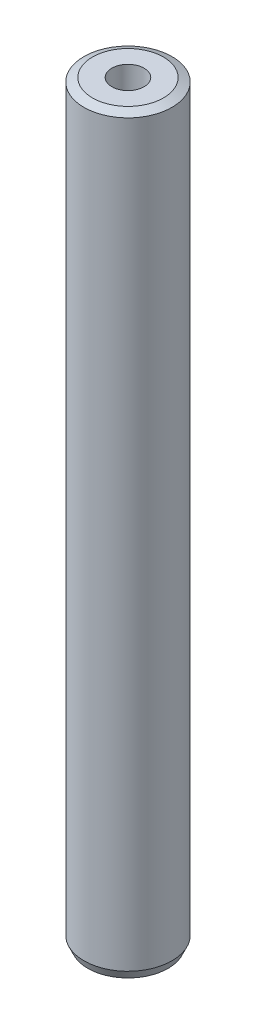
ISO-10303-21;
HEADER;
FILE_DESCRIPTION(('STEP AP214'),'2;1');
FILE_NAME('part.step','',(''),(''),'','','');
FILE_SCHEMA(('AUTOMOTIVE_DESIGN { 1 0 10303 214 1 1 1 1 }'));
ENDSEC;
DATA;
#1=APPLICATION_CONTEXT('core data for automotive mechanical design processes');
#2=APPLICATION_PROTOCOL_DEFINITION('international standard','automotive_design',2000,#1);
#3=PRODUCT_CONTEXT('',#1,'mechanical');
#4=PRODUCT('Part','Part','',(#3));
#5=PRODUCT_RELATED_PRODUCT_CATEGORY('part','',(#4));
#6=PRODUCT_DEFINITION_FORMATION('','',#4);
#7=PRODUCT_DEFINITION_CONTEXT('part definition',#1,'design');
#8=PRODUCT_DEFINITION('design','',#6,#7);
#9=PRODUCT_DEFINITION_SHAPE('','',#8);
#10=(LENGTH_UNIT() NAMED_UNIT(*) SI_UNIT(.MILLI.,.METRE.));
#11=(NAMED_UNIT(*) PLANE_ANGLE_UNIT() SI_UNIT($,.RADIAN.));
#12=(NAMED_UNIT(*) SI_UNIT($,.STERADIAN.) SOLID_ANGLE_UNIT());
#13=UNCERTAINTY_MEASURE_WITH_UNIT(LENGTH_MEASURE(1.E-05),#10,'distance_accuracy_value','');
#14=(GEOMETRIC_REPRESENTATION_CONTEXT(3) GLOBAL_UNCERTAINTY_ASSIGNED_CONTEXT((#13)) GLOBAL_UNIT_ASSIGNED_CONTEXT((#10,
#11,#12)) REPRESENTATION_CONTEXT('',''));
#15=CARTESIAN_POINT('',(0.,0.,0.));
#16=DIRECTION('',(0.,0.,1.));
#17=DIRECTION('',(1.,0.,0.));
#18=AXIS2_PLACEMENT_3D('',#15,#16,#17);
#19=CARTESIAN_POINT('',(0.,256.022970796596,0.));
#20=DIRECTION('',(0.,-1.,0.));
#21=DIRECTION('',(0.,0.,-1.));
#22=AXIS2_PLACEMENT_3D('',#19,#20,#21);
#23=CYLINDRICAL_SURFACE('',#22,15.);
#24=CARTESIAN_POINT('',(0.,254.702299618626,0.));
#25=DIRECTION('',(0.,1.,0.));
#26=DIRECTION('',(0.,0.,1.));
#27=AXIS2_PLACEMENT_3D('',#24,#25,#26);
#28=CIRCLE('',#27,15.);
#29=CARTESIAN_POINT('',(0.,254.702299618626,15.));
#30=VERTEX_POINT('',#29);
#31=EDGE_CURVE('E50',#30,#30,#28,.F.);
#32=ORIENTED_EDGE('',*,*,#31,.T.);
#33=EDGE_LOOP('',(#32));
#34=FACE_BOUND('',#33,.T.);
#35=CARTESIAN_POINT('',(0.,2.91356276093663,0.));
#36=DIRECTION('',(0.,1.,0.));
#37=DIRECTION('',(0.,0.,1.));
#38=AXIS2_PLACEMENT_3D('',#35,#36,#37);
#39=CIRCLE('',#38,15.);
#40=CARTESIAN_POINT('',(0.,2.91356276093663,15.));
#41=VERTEX_POINT('',#40);
#42=EDGE_CURVE('E51',#41,#41,#39,.T.);
#43=ORIENTED_EDGE('',*,*,#42,.T.);
#44=EDGE_LOOP('',(#43));
#45=FACE_BOUND('',#44,.T.);
#46=ADVANCED_FACE('F39',(#34,#45),#23,.T.);
#47=CARTESIAN_POINT('',(0.,256.022970796596,0.));
#48=DIRECTION('',(0.,1.,0.));
#49=DIRECTION('',(0.,0.,1.));
#50=AXIS2_PLACEMENT_3D('',#47,#48,#49);
#51=PLANE('',#50);
#52=CARTESIAN_POINT('',(0.,256.022970796596,0.));
#53=DIRECTION('',(0.,1.,0.));
#54=DIRECTION('',(0.,0.,1.));
#55=AXIS2_PLACEMENT_3D('',#52,#53,#54);
#56=CIRCLE('',#55,12.0864372390633);
#57=CARTESIAN_POINT('',(0.,256.022970796596,12.0864372390633));
#58=VERTEX_POINT('',#57);
#59=EDGE_CURVE('E54',#58,#58,#56,.T.);
#60=ORIENTED_EDGE('',*,*,#59,.T.);
#61=EDGE_LOOP('',(#60));
#62=FACE_BOUND('',#61,.T.);
#63=CARTESIAN_POINT('',(0.,256.022970796596,0.));
#64=DIRECTION('',(0.,1.,0.));
#65=DIRECTION('',(0.,0.,1.));
#66=AXIS2_PLACEMENT_3D('',#63,#64,#65);
#67=CIRCLE('',#66,5.49301980038942);
#68=CARTESIAN_POINT('',(0.,256.022970796596,5.49301980038942));
#69=VERTEX_POINT('',#68);
#70=EDGE_CURVE('E58',#69,#69,#67,.T.);
#71=ORIENTED_EDGE('',*,*,#70,.F.);
#72=EDGE_LOOP('',(#71));
#73=FACE_BOUND('',#72,.T.);
#74=ADVANCED_FACE('F69',(#62,#73),#51,.T.);
#75=CARTESIAN_POINT('',(0.,0.,0.));
#76=DIRECTION('',(0.,1.,0.));
#77=DIRECTION('',(0.,0.,1.));
#78=AXIS2_PLACEMENT_3D('',#75,#76,#77);
#79=PLANE('',#78);
#80=CARTESIAN_POINT('',(0.,0.,0.));
#81=DIRECTION('',(0.,1.,0.));
#82=DIRECTION('',(0.,0.,1.));
#83=AXIS2_PLACEMENT_3D('',#80,#81,#82);
#84=CIRCLE('',#83,13.6793288220302);
#85=CARTESIAN_POINT('',(0.,0.,13.6793288220302));
#86=VERTEX_POINT('',#85);
#87=EDGE_CURVE('E10',#86,#86,#84,.F.);
#88=ORIENTED_EDGE('',*,*,#87,.T.);
#89=EDGE_LOOP('',(#88));
#90=FACE_BOUND('',#89,.T.);
#91=CARTESIAN_POINT('',(0.,0.,0.));
#92=DIRECTION('',(0.,1.,0.));
#93=DIRECTION('',(0.,0.,1.));
#94=AXIS2_PLACEMENT_3D('',#91,#92,#93);
#95=CIRCLE('',#94,5.49301980038942);
#96=CARTESIAN_POINT('',(0.,0.,5.49301980038942));
#97=VERTEX_POINT('',#96);
#98=EDGE_CURVE('E63',#97,#97,#95,.T.);
#99=ORIENTED_EDGE('',*,*,#98,.T.);
#100=EDGE_LOOP('',(#99));
#101=FACE_BOUND('',#100,.T.);
#102=ADVANCED_FACE('F75',(#90,#101),#79,.F.);
#103=CARTESIAN_POINT('',(0.,256.022970796596,0.));
#104=DIRECTION('',(0.,-1.,0.));
#105=DIRECTION('',(0.,0.,-1.));
#106=AXIS2_PLACEMENT_3D('',#103,#104,#105);
#107=CYLINDRICAL_SURFACE('',#106,5.49301980038942);
#108=ORIENTED_EDGE('',*,*,#70,.T.);
#109=EDGE_LOOP('',(#108));
#110=FACE_BOUND('',#109,.T.);
#111=ORIENTED_EDGE('',*,*,#98,.F.);
#112=EDGE_LOOP('',(#111));
#113=FACE_BOUND('',#112,.T.);
#114=ADVANCED_FACE('F70',(#110,#113),#107,.F.);
#115=CARTESIAN_POINT('',(0.,256.022970796596,0.));
#116=DIRECTION('',(0.,-1.,0.));
#117=DIRECTION('',(0.,0.,-1.));
#118=AXIS2_PLACEMENT_3D('',#115,#116,#117);
#119=CONICAL_SURFACE('',#118,12.0864372390633,1.14521484062441);
#120=ORIENTED_EDGE('',*,*,#31,.F.);
#121=EDGE_LOOP('',(#120));
#122=FACE_BOUND('',#121,.T.);
#123=ORIENTED_EDGE('',*,*,#59,.F.);
#124=EDGE_LOOP('',(#123));
#125=FACE_BOUND('',#124,.T.);
#126=ADVANCED_FACE('F81',(#122,#125),#119,.T.);
#127=CARTESIAN_POINT('',(0.,2.91356276093663,0.));
#128=DIRECTION('',(0.,1.,0.));
#129=DIRECTION('',(0.,0.,1.));
#130=AXIS2_PLACEMENT_3D('',#127,#128,#129);
#131=CONICAL_SURFACE('',#130,15.,0.425581486170492);
#132=ORIENTED_EDGE('',*,*,#87,.F.);
#133=EDGE_LOOP('',(#132));
#134=FACE_BOUND('',#133,.T.);
#135=ORIENTED_EDGE('',*,*,#42,.F.);
#136=EDGE_LOOP('',(#135));
#137=FACE_BOUND('',#136,.T.);
#138=ADVANCED_FACE('F45',(#134,#137),#131,.T.);
#139=CLOSED_SHELL('',(#46,#74,#102,#114,#126,#138));
#140=MANIFOLD_SOLID_BREP('B2',#139);
#141=ADVANCED_BREP_SHAPE_REPRESENTATION('',(#18,#140),#14);
#142=SHAPE_DEFINITION_REPRESENTATION(#9,#141);
ENDSEC;
END-ISO-10303-21;
